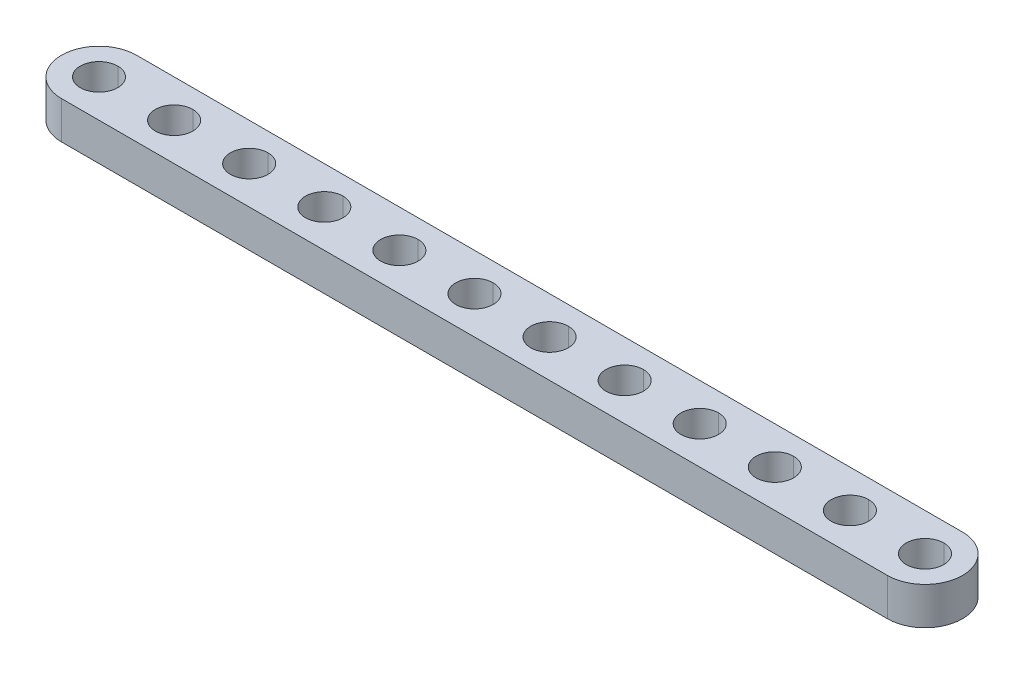
ISO-10303-21;
HEADER;
FILE_DESCRIPTION(('STEP AP214'),'2;1');
FILE_NAME('part.step','',(''),(''),'','','');
FILE_SCHEMA(('AUTOMOTIVE_DESIGN { 1 0 10303 214 1 1 1 1 }'));
ENDSEC;
DATA;
#1=APPLICATION_CONTEXT('core data for automotive mechanical design processes');
#2=APPLICATION_PROTOCOL_DEFINITION('international standard','automotive_design',2000,#1);
#3=PRODUCT_CONTEXT('',#1,'mechanical');
#4=PRODUCT('Part','Part','',(#3));
#5=PRODUCT_RELATED_PRODUCT_CATEGORY('part','',(#4));
#6=PRODUCT_DEFINITION_FORMATION('','',#4);
#7=PRODUCT_DEFINITION_CONTEXT('part definition',#1,'design');
#8=PRODUCT_DEFINITION('design','',#6,#7);
#9=PRODUCT_DEFINITION_SHAPE('','',#8);
#10=(LENGTH_UNIT() NAMED_UNIT(*) SI_UNIT(.MILLI.,.METRE.));
#11=(NAMED_UNIT(*) PLANE_ANGLE_UNIT() SI_UNIT($,.RADIAN.));
#12=(NAMED_UNIT(*) SI_UNIT($,.STERADIAN.) SOLID_ANGLE_UNIT());
#13=UNCERTAINTY_MEASURE_WITH_UNIT(LENGTH_MEASURE(1.E-05),#10,'distance_accuracy_value','');
#14=(GEOMETRIC_REPRESENTATION_CONTEXT(3) GLOBAL_UNCERTAINTY_ASSIGNED_CONTEXT((#13)) GLOBAL_UNIT_ASSIGNED_CONTEXT((#10,
#11,#12)) REPRESENTATION_CONTEXT('',''));
#15=CARTESIAN_POINT('',(0.,0.,0.));
#16=DIRECTION('',(0.,0.,1.));
#17=DIRECTION('',(1.,0.,0.));
#18=AXIS2_PLACEMENT_3D('',#15,#16,#17);
#19=CARTESIAN_POINT('',(44.,4.,0.));
#20=DIRECTION('',(0.,1.,0.));
#21=DIRECTION('',(0.,0.,1.));
#22=AXIS2_PLACEMENT_3D('',#19,#20,#21);
#23=CYLINDRICAL_SURFACE('',#22,2.);
#24=DIRECTION('',(0.,1.,0.));
#25=VECTOR('',#24,1.);
#26=CARTESIAN_POINT('',(44.,4.,-2.));
#27=LINE('',#26,#25);
#28=CARTESIAN_POINT('',(44.,0.,-2.));
#29=VERTEX_POINT('',#28);
#30=CARTESIAN_POINT('',(44.,4.,-2.));
#31=VERTEX_POINT('',#30);
#32=EDGE_CURVE('E409',#29,#31,#27,.T.);
#33=ORIENTED_EDGE('',*,*,#32,.F.);
#34=CARTESIAN_POINT('',(44.,0.,0.));
#35=DIRECTION('',(0.,1.,0.));
#36=DIRECTION('',(0.,0.,1.));
#37=AXIS2_PLACEMENT_3D('',#34,#35,#36);
#38=CIRCLE('',#37,2.);
#39=CARTESIAN_POINT('',(44.,0.,2.));
#40=VERTEX_POINT('',#39);
#41=EDGE_CURVE('E397',#40,#29,#38,.T.);
#42=ORIENTED_EDGE('',*,*,#41,.F.);
#43=DIRECTION('',(0.,1.,0.));
#44=VECTOR('',#43,1.);
#45=CARTESIAN_POINT('',(44.,4.,2.));
#46=LINE('',#45,#44);
#47=CARTESIAN_POINT('',(44.,4.,2.));
#48=VERTEX_POINT('',#47);
#49=EDGE_CURVE('E379',#40,#48,#46,.T.);
#50=ORIENTED_EDGE('',*,*,#49,.T.);
#51=CARTESIAN_POINT('',(44.,4.,0.));
#52=DIRECTION('',(0.,1.,0.));
#53=DIRECTION('',(0.,0.,1.));
#54=AXIS2_PLACEMENT_3D('',#51,#52,#53);
#55=CIRCLE('',#54,2.);
#56=EDGE_CURVE('E262',#48,#31,#55,.T.);
#57=ORIENTED_EDGE('',*,*,#56,.T.);
#58=EDGE_LOOP('',(#33,#42,#50,#57));
#59=FACE_BOUND('',#58,.T.);
#60=ADVANCED_FACE('F15',(#59),#23,.F.);
#61=CARTESIAN_POINT('',(36.,4.,0.));
#62=DIRECTION('',(0.,1.,0.));
#63=DIRECTION('',(0.,0.,1.));
#64=AXIS2_PLACEMENT_3D('',#61,#62,#63);
#65=CYLINDRICAL_SURFACE('',#64,2.);
#66=DIRECTION('',(0.,1.,0.));
#67=VECTOR('',#66,1.);
#68=CARTESIAN_POINT('',(36.,4.,-2.));
#69=LINE('',#68,#67);
#70=CARTESIAN_POINT('',(36.,0.,-2.));
#71=VERTEX_POINT('',#70);
#72=CARTESIAN_POINT('',(36.,4.,-2.));
#73=VERTEX_POINT('',#72);
#74=EDGE_CURVE('E378',#71,#73,#69,.T.);
#75=ORIENTED_EDGE('',*,*,#74,.F.);
#76=CARTESIAN_POINT('',(36.,0.,0.));
#77=DIRECTION('',(0.,1.,0.));
#78=DIRECTION('',(0.,0.,1.));
#79=AXIS2_PLACEMENT_3D('',#76,#77,#78);
#80=CIRCLE('',#79,2.);
#81=CARTESIAN_POINT('',(36.,0.,2.));
#82=VERTEX_POINT('',#81);
#83=EDGE_CURVE('E216',#82,#71,#80,.T.);
#84=ORIENTED_EDGE('',*,*,#83,.F.);
#85=DIRECTION('',(0.,1.,0.));
#86=VECTOR('',#85,1.);
#87=CARTESIAN_POINT('',(36.,4.,2.));
#88=LINE('',#87,#86);
#89=CARTESIAN_POINT('',(36.,4.,2.));
#90=VERTEX_POINT('',#89);
#91=EDGE_CURVE('E337',#82,#90,#88,.T.);
#92=ORIENTED_EDGE('',*,*,#91,.T.);
#93=CARTESIAN_POINT('',(36.,4.,0.));
#94=DIRECTION('',(0.,1.,0.));
#95=DIRECTION('',(0.,0.,1.));
#96=AXIS2_PLACEMENT_3D('',#93,#94,#95);
#97=CIRCLE('',#96,2.);
#98=EDGE_CURVE('E266',#90,#73,#97,.T.);
#99=ORIENTED_EDGE('',*,*,#98,.T.);
#100=EDGE_LOOP('',(#75,#84,#92,#99));
#101=FACE_BOUND('',#100,.T.);
#102=ADVANCED_FACE('F509',(#101),#65,.F.);
#103=CARTESIAN_POINT('',(28.,4.,0.));
#104=DIRECTION('',(0.,1.,0.));
#105=DIRECTION('',(0.,0.,1.));
#106=AXIS2_PLACEMENT_3D('',#103,#104,#105);
#107=CYLINDRICAL_SURFACE('',#106,2.);
#108=DIRECTION('',(0.,1.,0.));
#109=VECTOR('',#108,1.);
#110=CARTESIAN_POINT('',(28.,4.,-2.));
#111=LINE('',#110,#109);
#112=CARTESIAN_POINT('',(28.,0.,-2.));
#113=VERTEX_POINT('',#112);
#114=CARTESIAN_POINT('',(28.,4.,-2.));
#115=VERTEX_POINT('',#114);
#116=EDGE_CURVE('E314',#113,#115,#111,.T.);
#117=ORIENTED_EDGE('',*,*,#116,.F.);
#118=CARTESIAN_POINT('',(28.,0.,0.));
#119=DIRECTION('',(0.,1.,0.));
#120=DIRECTION('',(0.,0.,1.));
#121=AXIS2_PLACEMENT_3D('',#118,#119,#120);
#122=CIRCLE('',#121,2.);
#123=CARTESIAN_POINT('',(28.,0.,2.));
#124=VERTEX_POINT('',#123);
#125=EDGE_CURVE('E212',#124,#113,#122,.T.);
#126=ORIENTED_EDGE('',*,*,#125,.F.);
#127=DIRECTION('',(0.,1.,0.));
#128=VECTOR('',#127,1.);
#129=CARTESIAN_POINT('',(28.,4.,2.));
#130=LINE('',#129,#128);
#131=CARTESIAN_POINT('',(28.,4.,2.));
#132=VERTEX_POINT('',#131);
#133=EDGE_CURVE('E271',#124,#132,#130,.T.);
#134=ORIENTED_EDGE('',*,*,#133,.T.);
#135=CARTESIAN_POINT('',(28.,4.,0.));
#136=DIRECTION('',(0.,1.,0.));
#137=DIRECTION('',(0.,0.,1.));
#138=AXIS2_PLACEMENT_3D('',#135,#136,#137);
#139=CIRCLE('',#138,2.);
#140=EDGE_CURVE('E205',#132,#115,#139,.T.);
#141=ORIENTED_EDGE('',*,*,#140,.T.);
#142=EDGE_LOOP('',(#117,#126,#134,#141));
#143=FACE_BOUND('',#142,.T.);
#144=ADVANCED_FACE('F310',(#143),#107,.F.);
#145=CARTESIAN_POINT('',(20.,4.,0.));
#146=DIRECTION('',(0.,1.,0.));
#147=DIRECTION('',(0.,0.,1.));
#148=AXIS2_PLACEMENT_3D('',#145,#146,#147);
#149=CYLINDRICAL_SURFACE('',#148,2.);
#150=DIRECTION('',(0.,1.,0.));
#151=VECTOR('',#150,1.);
#152=CARTESIAN_POINT('',(20.,4.,-2.));
#153=LINE('',#152,#151);
#154=CARTESIAN_POINT('',(20.,0.,-2.));
#155=VERTEX_POINT('',#154);
#156=CARTESIAN_POINT('',(20.,4.,-2.));
#157=VERTEX_POINT('',#156);
#158=EDGE_CURVE('E270',#155,#157,#153,.T.);
#159=ORIENTED_EDGE('',*,*,#158,.F.);
#160=CARTESIAN_POINT('',(20.,0.,0.));
#161=DIRECTION('',(0.,1.,0.));
#162=DIRECTION('',(0.,0.,1.));
#163=AXIS2_PLACEMENT_3D('',#160,#161,#162);
#164=CIRCLE('',#163,2.);
#165=CARTESIAN_POINT('',(20.,0.,2.));
#166=VERTEX_POINT('',#165);
#167=EDGE_CURVE('E19',#166,#155,#164,.T.);
#168=ORIENTED_EDGE('',*,*,#167,.F.);
#169=DIRECTION('',(0.,1.,0.));
#170=VECTOR('',#169,1.);
#171=CARTESIAN_POINT('',(20.,4.,2.));
#172=LINE('',#171,#170);
#173=CARTESIAN_POINT('',(20.,4.,2.));
#174=VERTEX_POINT('',#173);
#175=EDGE_CURVE('E254',#166,#174,#172,.T.);
#176=ORIENTED_EDGE('',*,*,#175,.T.);
#177=CARTESIAN_POINT('',(20.,4.,0.));
#178=DIRECTION('',(0.,1.,0.));
#179=DIRECTION('',(0.,0.,1.));
#180=AXIS2_PLACEMENT_3D('',#177,#178,#179);
#181=CIRCLE('',#180,2.);
#182=EDGE_CURVE('E201',#174,#157,#181,.T.);
#183=ORIENTED_EDGE('',*,*,#182,.T.);
#184=EDGE_LOOP('',(#159,#168,#176,#183));
#185=FACE_BOUND('',#184,.T.);
#186=ADVANCED_FACE('F452',(#185),#149,.F.);
#187=CARTESIAN_POINT('',(12.,4.,0.));
#188=DIRECTION('',(0.,1.,0.));
#189=DIRECTION('',(0.,0.,1.));
#190=AXIS2_PLACEMENT_3D('',#187,#188,#189);
#191=CYLINDRICAL_SURFACE('',#190,2.);
#192=DIRECTION('',(0.,1.,0.));
#193=VECTOR('',#192,1.);
#194=CARTESIAN_POINT('',(12.,4.,-2.));
#195=LINE('',#194,#193);
#196=CARTESIAN_POINT('',(12.,0.,-2.));
#197=VERTEX_POINT('',#196);
#198=CARTESIAN_POINT('',(12.,4.,-2.));
#199=VERTEX_POINT('',#198);
#200=EDGE_CURVE('E253',#197,#199,#195,.T.);
#201=ORIENTED_EDGE('',*,*,#200,.F.);
#202=CARTESIAN_POINT('',(12.,0.,0.));
#203=DIRECTION('',(0.,1.,0.));
#204=DIRECTION('',(0.,0.,1.));
#205=AXIS2_PLACEMENT_3D('',#202,#203,#204);
#206=CIRCLE('',#205,2.);
#207=CARTESIAN_POINT('',(12.,0.,2.));
#208=VERTEX_POINT('',#207);
#209=EDGE_CURVE('E396',#208,#197,#206,.T.);
#210=ORIENTED_EDGE('',*,*,#209,.F.);
#211=DIRECTION('',(0.,1.,0.));
#212=VECTOR('',#211,1.);
#213=CARTESIAN_POINT('',(12.,4.,2.));
#214=LINE('',#213,#212);
#215=CARTESIAN_POINT('',(12.,4.,2.));
#216=VERTEX_POINT('',#215);
#217=EDGE_CURVE('E296',#208,#216,#214,.T.);
#218=ORIENTED_EDGE('',*,*,#217,.T.);
#219=CARTESIAN_POINT('',(12.,4.,0.));
#220=DIRECTION('',(0.,1.,0.));
#221=DIRECTION('',(0.,0.,1.));
#222=AXIS2_PLACEMENT_3D('',#219,#220,#221);
#223=CIRCLE('',#222,2.);
#224=EDGE_CURVE('E204',#216,#199,#223,.T.);
#225=ORIENTED_EDGE('',*,*,#224,.T.);
#226=EDGE_LOOP('',(#201,#210,#218,#225));
#227=FACE_BOUND('',#226,.T.);
#228=ADVANCED_FACE('F17',(#227),#191,.F.);
#229=CARTESIAN_POINT('',(4.,4.,0.));
#230=DIRECTION('',(0.,1.,0.));
#231=DIRECTION('',(0.,0.,1.));
#232=AXIS2_PLACEMENT_3D('',#229,#230,#231);
#233=CYLINDRICAL_SURFACE('',#232,2.);
#234=DIRECTION('',(0.,1.,0.));
#235=VECTOR('',#234,1.);
#236=CARTESIAN_POINT('',(4.,4.,-2.));
#237=LINE('',#236,#235);
#238=CARTESIAN_POINT('',(4.,0.,-2.));
#239=VERTEX_POINT('',#238);
#240=CARTESIAN_POINT('',(4.,4.,-2.));
#241=VERTEX_POINT('',#240);
#242=EDGE_CURVE('E245',#239,#241,#237,.T.);
#243=ORIENTED_EDGE('',*,*,#242,.F.);
#244=CARTESIAN_POINT('',(4.,0.,0.));
#245=DIRECTION('',(0.,1.,0.));
#246=DIRECTION('',(0.,0.,1.));
#247=AXIS2_PLACEMENT_3D('',#244,#245,#246);
#248=CIRCLE('',#247,2.);
#249=CARTESIAN_POINT('',(4.,0.,2.));
#250=VERTEX_POINT('',#249);
#251=EDGE_CURVE('E221',#250,#239,#248,.T.);
#252=ORIENTED_EDGE('',*,*,#251,.F.);
#253=DIRECTION('',(0.,1.,0.));
#254=VECTOR('',#253,1.);
#255=CARTESIAN_POINT('',(4.,4.,2.));
#256=LINE('',#255,#254);
#257=CARTESIAN_POINT('',(4.,4.,2.));
#258=VERTEX_POINT('',#257);
#259=EDGE_CURVE('E244',#250,#258,#256,.T.);
#260=ORIENTED_EDGE('',*,*,#259,.T.);
#261=CARTESIAN_POINT('',(4.,4.,0.));
#262=DIRECTION('',(0.,1.,0.));
#263=DIRECTION('',(0.,0.,1.));
#264=AXIS2_PLACEMENT_3D('',#261,#262,#263);
#265=CIRCLE('',#264,2.);
#266=EDGE_CURVE('E211',#258,#241,#265,.T.);
#267=ORIENTED_EDGE('',*,*,#266,.T.);
#268=EDGE_LOOP('',(#243,#252,#260,#267));
#269=FACE_BOUND('',#268,.T.);
#270=ADVANCED_FACE('F651',(#269),#233,.F.);
#271=CARTESIAN_POINT('',(-4.,4.,0.));
#272=DIRECTION('',(0.,1.,0.));
#273=DIRECTION('',(0.,0.,1.));
#274=AXIS2_PLACEMENT_3D('',#271,#272,#273);
#275=CYLINDRICAL_SURFACE('',#274,2.);
#276=DIRECTION('',(0.,1.,0.));
#277=VECTOR('',#276,1.);
#278=CARTESIAN_POINT('',(-4.,4.,-2.));
#279=LINE('',#278,#277);
#280=CARTESIAN_POINT('',(-4.,0.,-2.));
#281=VERTEX_POINT('',#280);
#282=CARTESIAN_POINT('',(-4.,4.,-2.));
#283=VERTEX_POINT('',#282);
#284=EDGE_CURVE('E276',#281,#283,#279,.T.);
#285=ORIENTED_EDGE('',*,*,#284,.F.);
#286=CARTESIAN_POINT('',(-4.,0.,0.));
#287=DIRECTION('',(0.,1.,0.));
#288=DIRECTION('',(0.,0.,1.));
#289=AXIS2_PLACEMENT_3D('',#286,#287,#288);
#290=CIRCLE('',#289,2.);
#291=CARTESIAN_POINT('',(-4.,0.,2.));
#292=VERTEX_POINT('',#291);
#293=EDGE_CURVE('E217',#292,#281,#290,.T.);
#294=ORIENTED_EDGE('',*,*,#293,.F.);
#295=DIRECTION('',(0.,1.,0.));
#296=VECTOR('',#295,1.);
#297=CARTESIAN_POINT('',(-4.,4.,2.));
#298=LINE('',#297,#296);
#299=CARTESIAN_POINT('',(-4.,4.,2.));
#300=VERTEX_POINT('',#299);
#301=EDGE_CURVE('E369',#292,#300,#298,.T.);
#302=ORIENTED_EDGE('',*,*,#301,.T.);
#303=CARTESIAN_POINT('',(-4.,4.,0.));
#304=DIRECTION('',(0.,1.,0.));
#305=DIRECTION('',(0.,0.,1.));
#306=AXIS2_PLACEMENT_3D('',#303,#304,#305);
#307=CIRCLE('',#306,2.);
#308=EDGE_CURVE('E206',#300,#283,#307,.T.);
#309=ORIENTED_EDGE('',*,*,#308,.T.);
#310=EDGE_LOOP('',(#285,#294,#302,#309));
#311=FACE_BOUND('',#310,.T.);
#312=ADVANCED_FACE('F777',(#311),#275,.F.);
#313=CARTESIAN_POINT('',(-12.,4.,0.));
#314=DIRECTION('',(0.,1.,0.));
#315=DIRECTION('',(0.,0.,1.));
#316=AXIS2_PLACEMENT_3D('',#313,#314,#315);
#317=CYLINDRICAL_SURFACE('',#316,2.);
#318=DIRECTION('',(0.,1.,0.));
#319=VECTOR('',#318,1.);
#320=CARTESIAN_POINT('',(-12.,4.,-2.));
#321=LINE('',#320,#319);
#322=CARTESIAN_POINT('',(-12.,0.,-2.));
#323=VERTEX_POINT('',#322);
#324=CARTESIAN_POINT('',(-12.,4.,-2.));
#325=VERTEX_POINT('',#324);
#326=EDGE_CURVE('E361',#323,#325,#321,.T.);
#327=ORIENTED_EDGE('',*,*,#326,.F.);
#328=CARTESIAN_POINT('',(-12.,0.,0.));
#329=DIRECTION('',(0.,1.,0.));
#330=DIRECTION('',(0.,0.,1.));
#331=AXIS2_PLACEMENT_3D('',#328,#329,#330);
#332=CIRCLE('',#331,2.);
#333=CARTESIAN_POINT('',(-12.,0.,2.));
#334=VERTEX_POINT('',#333);
#335=EDGE_CURVE('E220',#334,#323,#332,.T.);
#336=ORIENTED_EDGE('',*,*,#335,.F.);
#337=DIRECTION('',(0.,1.,0.));
#338=VECTOR('',#337,1.);
#339=CARTESIAN_POINT('',(-12.,4.,2.));
#340=LINE('',#339,#338);
#341=CARTESIAN_POINT('',(-12.,4.,2.));
#342=VERTEX_POINT('',#341);
#343=EDGE_CURVE('E360',#334,#342,#340,.T.);
#344=ORIENTED_EDGE('',*,*,#343,.T.);
#345=CARTESIAN_POINT('',(-12.,4.,0.));
#346=DIRECTION('',(0.,1.,0.));
#347=DIRECTION('',(0.,0.,1.));
#348=AXIS2_PLACEMENT_3D('',#345,#346,#347);
#349=CIRCLE('',#348,2.);
#350=EDGE_CURVE('E210',#342,#325,#349,.T.);
#351=ORIENTED_EDGE('',*,*,#350,.T.);
#352=EDGE_LOOP('',(#327,#336,#344,#351));
#353=FACE_BOUND('',#352,.T.);
#354=ADVANCED_FACE('F430',(#353),#317,.F.);
#355=CARTESIAN_POINT('',(-20.,4.,0.));
#356=DIRECTION('',(0.,1.,0.));
#357=DIRECTION('',(0.,0.,1.));
#358=AXIS2_PLACEMENT_3D('',#355,#356,#357);
#359=CYLINDRICAL_SURFACE('',#358,2.);
#360=DIRECTION('',(0.,1.,0.));
#361=VECTOR('',#360,1.);
#362=CARTESIAN_POINT('',(-20.,4.,-2.));
#363=LINE('',#362,#361);
#364=CARTESIAN_POINT('',(-20.,0.,-2.));
#365=VERTEX_POINT('',#364);
#366=CARTESIAN_POINT('',(-20.,4.,-2.));
#367=VERTEX_POINT('',#366);
#368=EDGE_CURVE('E392',#365,#367,#363,.T.);
#369=ORIENTED_EDGE('',*,*,#368,.F.);
#370=CARTESIAN_POINT('',(-20.,0.,0.));
#371=DIRECTION('',(0.,1.,0.));
#372=DIRECTION('',(0.,0.,1.));
#373=AXIS2_PLACEMENT_3D('',#370,#371,#372);
#374=CIRCLE('',#373,2.);
#375=CARTESIAN_POINT('',(-20.,0.,2.));
#376=VERTEX_POINT('',#375);
#377=EDGE_CURVE('E224',#376,#365,#374,.T.);
#378=ORIENTED_EDGE('',*,*,#377,.F.);
#379=DIRECTION('',(0.,1.,0.));
#380=VECTOR('',#379,1.);
#381=CARTESIAN_POINT('',(-20.,4.,2.));
#382=LINE('',#381,#380);
#383=CARTESIAN_POINT('',(-20.,4.,2.));
#384=VERTEX_POINT('',#383);
#385=EDGE_CURVE('E297',#376,#384,#382,.T.);
#386=ORIENTED_EDGE('',*,*,#385,.T.);
#387=CARTESIAN_POINT('',(-20.,4.,0.));
#388=DIRECTION('',(0.,1.,0.));
#389=DIRECTION('',(0.,0.,1.));
#390=AXIS2_PLACEMENT_3D('',#387,#388,#389);
#391=CIRCLE('',#390,2.);
#392=EDGE_CURVE('E284',#384,#367,#391,.T.);
#393=ORIENTED_EDGE('',*,*,#392,.T.);
#394=EDGE_LOOP('',(#369,#378,#386,#393));
#395=FACE_BOUND('',#394,.T.);
#396=ADVANCED_FACE('F995',(#395),#359,.F.);
#397=CARTESIAN_POINT('',(-28.,4.,0.));
#398=DIRECTION('',(0.,1.,0.));
#399=DIRECTION('',(0.,0.,1.));
#400=AXIS2_PLACEMENT_3D('',#397,#398,#399);
#401=CYLINDRICAL_SURFACE('',#400,2.);
#402=DIRECTION('',(0.,1.,0.));
#403=VECTOR('',#402,1.);
#404=CARTESIAN_POINT('',(-28.,4.,-2.));
#405=LINE('',#404,#403);
#406=CARTESIAN_POINT('',(-28.,0.,-2.));
#407=VERTEX_POINT('',#406);
#408=CARTESIAN_POINT('',(-28.,4.,-2.));
#409=VERTEX_POINT('',#408);
#410=EDGE_CURVE('E234',#407,#409,#405,.T.);
#411=ORIENTED_EDGE('',*,*,#410,.F.);
#412=CARTESIAN_POINT('',(-28.,0.,0.));
#413=DIRECTION('',(0.,1.,0.));
#414=DIRECTION('',(0.,0.,1.));
#415=AXIS2_PLACEMENT_3D('',#412,#413,#414);
#416=CIRCLE('',#415,2.);
#417=CARTESIAN_POINT('',(-28.,0.,2.));
#418=VERTEX_POINT('',#417);
#419=EDGE_CURVE('E230',#418,#407,#416,.T.);
#420=ORIENTED_EDGE('',*,*,#419,.F.);
#421=DIRECTION('',(0.,1.,0.));
#422=VECTOR('',#421,1.);
#423=CARTESIAN_POINT('',(-28.,4.,2.));
#424=LINE('',#423,#422);
#425=CARTESIAN_POINT('',(-28.,4.,2.));
#426=VERTEX_POINT('',#425);
#427=EDGE_CURVE('E470',#418,#426,#424,.T.);
#428=ORIENTED_EDGE('',*,*,#427,.T.);
#429=CARTESIAN_POINT('',(-28.,4.,0.));
#430=DIRECTION('',(0.,1.,0.));
#431=DIRECTION('',(0.,0.,1.));
#432=AXIS2_PLACEMENT_3D('',#429,#430,#431);
#433=CIRCLE('',#432,2.);
#434=EDGE_CURVE('E166',#426,#409,#433,.T.);
#435=ORIENTED_EDGE('',*,*,#434,.T.);
#436=EDGE_LOOP('',(#411,#420,#428,#435));
#437=FACE_BOUND('',#436,.T.);
#438=ADVANCED_FACE('F894',(#437),#401,.F.);
#439=CARTESIAN_POINT('',(-36.,4.,0.));
#440=DIRECTION('',(0.,1.,0.));
#441=DIRECTION('',(0.,0.,1.));
#442=AXIS2_PLACEMENT_3D('',#439,#440,#441);
#443=CYLINDRICAL_SURFACE('',#442,2.);
#444=DIRECTION('',(0.,1.,0.));
#445=VECTOR('',#444,1.);
#446=CARTESIAN_POINT('',(-36.,4.,-2.));
#447=LINE('',#446,#445);
#448=CARTESIAN_POINT('',(-36.,0.,-2.));
#449=VERTEX_POINT('',#448);
#450=CARTESIAN_POINT('',(-36.,4.,-2.));
#451=VERTEX_POINT('',#450);
#452=EDGE_CURVE('E179',#449,#451,#447,.T.);
#453=ORIENTED_EDGE('',*,*,#452,.F.);
#454=CARTESIAN_POINT('',(-36.,0.,0.));
#455=DIRECTION('',(0.,1.,0.));
#456=DIRECTION('',(0.,0.,1.));
#457=AXIS2_PLACEMENT_3D('',#454,#455,#456);
#458=CIRCLE('',#457,2.);
#459=CARTESIAN_POINT('',(-36.,0.,2.));
#460=VERTEX_POINT('',#459);
#461=EDGE_CURVE('E26',#460,#449,#458,.T.);
#462=ORIENTED_EDGE('',*,*,#461,.F.);
#463=DIRECTION('',(0.,1.,0.));
#464=VECTOR('',#463,1.);
#465=CARTESIAN_POINT('',(-36.,4.,2.));
#466=LINE('',#465,#464);
#467=CARTESIAN_POINT('',(-36.,4.,2.));
#468=VERTEX_POINT('',#467);
#469=EDGE_CURVE('E170',#460,#468,#466,.T.);
#470=ORIENTED_EDGE('',*,*,#469,.T.);
#471=CARTESIAN_POINT('',(-36.,4.,0.));
#472=DIRECTION('',(0.,1.,0.));
#473=DIRECTION('',(0.,0.,1.));
#474=AXIS2_PLACEMENT_3D('',#471,#472,#473);
#475=CIRCLE('',#474,2.);
#476=EDGE_CURVE('E155',#468,#451,#475,.T.);
#477=ORIENTED_EDGE('',*,*,#476,.T.);
#478=EDGE_LOOP('',(#453,#462,#470,#477));
#479=FACE_BOUND('',#478,.T.);
#480=ADVANCED_FACE('F171',(#479),#443,.F.);
#481=CARTESIAN_POINT('',(-44.,4.,0.));
#482=DIRECTION('',(0.,1.,0.));
#483=DIRECTION('',(0.,0.,1.));
#484=AXIS2_PLACEMENT_3D('',#481,#482,#483);
#485=CYLINDRICAL_SURFACE('',#484,2.);
#486=DIRECTION('',(0.,1.,0.));
#487=VECTOR('',#486,1.);
#488=CARTESIAN_POINT('',(-44.,4.,-2.));
#489=LINE('',#488,#487);
#490=CARTESIAN_POINT('',(-44.,0.,-2.));
#491=VERTEX_POINT('',#490);
#492=CARTESIAN_POINT('',(-44.,4.,-2.));
#493=VERTEX_POINT('',#492);
#494=EDGE_CURVE('E195',#491,#493,#489,.T.);
#495=ORIENTED_EDGE('',*,*,#494,.F.);
#496=CARTESIAN_POINT('',(-44.,0.,0.));
#497=DIRECTION('',(0.,1.,0.));
#498=DIRECTION('',(0.,0.,1.));
#499=AXIS2_PLACEMENT_3D('',#496,#497,#498);
#500=CIRCLE('',#499,2.);
#501=CARTESIAN_POINT('',(-44.,0.,2.));
#502=VERTEX_POINT('',#501);
#503=EDGE_CURVE('E10',#502,#491,#500,.T.);
#504=ORIENTED_EDGE('',*,*,#503,.F.);
#505=DIRECTION('',(0.,1.,0.));
#506=VECTOR('',#505,1.);
#507=CARTESIAN_POINT('',(-44.,4.,2.));
#508=LINE('',#507,#506);
#509=CARTESIAN_POINT('',(-44.,4.,2.));
#510=VERTEX_POINT('',#509);
#511=EDGE_CURVE('E347',#502,#510,#508,.T.);
#512=ORIENTED_EDGE('',*,*,#511,.T.);
#513=CARTESIAN_POINT('',(-44.,4.,0.));
#514=DIRECTION('',(0.,1.,0.));
#515=DIRECTION('',(0.,0.,1.));
#516=AXIS2_PLACEMENT_3D('',#513,#514,#515);
#517=CIRCLE('',#516,2.);
#518=EDGE_CURVE('E165',#510,#493,#517,.T.);
#519=ORIENTED_EDGE('',*,*,#518,.T.);
#520=EDGE_LOOP('',(#495,#504,#512,#519));
#521=FACE_BOUND('',#520,.T.);
#522=ADVANCED_FACE('F658',(#521),#485,.F.);
#523=CARTESIAN_POINT('',(-44.,0.,0.));
#524=DIRECTION('',(0.,1.,0.));
#525=DIRECTION('',(1.,0.,0.));
#526=AXIS2_PLACEMENT_3D('',#523,#524,#525);
#527=PLANE('',#526);
#528=ORIENTED_EDGE('',*,*,#503,.T.);
#529=CARTESIAN_POINT('',(-44.,0.,0.));
#530=DIRECTION('',(0.,1.,0.));
#531=DIRECTION('',(0.,0.,1.));
#532=AXIS2_PLACEMENT_3D('',#529,#530,#531);
#533=CIRCLE('',#532,2.);
#534=EDGE_CURVE('E176',#491,#502,#533,.T.);
#535=ORIENTED_EDGE('',*,*,#534,.T.);
#536=EDGE_LOOP('',(#528,#535));
#537=FACE_BOUND('',#536,.T.);
#538=ORIENTED_EDGE('',*,*,#461,.T.);
#539=CARTESIAN_POINT('',(-36.,0.,0.));
#540=DIRECTION('',(0.,1.,0.));
#541=DIRECTION('',(0.,0.,1.));
#542=AXIS2_PLACEMENT_3D('',#539,#540,#541);
#543=CIRCLE('',#542,2.);
#544=EDGE_CURVE('E187',#449,#460,#543,.T.);
#545=ORIENTED_EDGE('',*,*,#544,.T.);
#546=EDGE_LOOP('',(#538,#545));
#547=FACE_BOUND('',#546,.T.);
#548=ORIENTED_EDGE('',*,*,#419,.T.);
#549=CARTESIAN_POINT('',(-28.,0.,0.));
#550=DIRECTION('',(0.,1.,0.));
#551=DIRECTION('',(0.,0.,1.));
#552=AXIS2_PLACEMENT_3D('',#549,#550,#551);
#553=CIRCLE('',#552,2.);
#554=EDGE_CURVE('E239',#407,#418,#553,.T.);
#555=ORIENTED_EDGE('',*,*,#554,.T.);
#556=EDGE_LOOP('',(#548,#555));
#557=FACE_BOUND('',#556,.T.);
#558=ORIENTED_EDGE('',*,*,#377,.T.);
#559=CARTESIAN_POINT('',(-20.,0.,0.));
#560=DIRECTION('',(0.,1.,0.));
#561=DIRECTION('',(0.,0.,1.));
#562=AXIS2_PLACEMENT_3D('',#559,#560,#561);
#563=CIRCLE('',#562,2.);
#564=EDGE_CURVE('E388',#365,#376,#563,.T.);
#565=ORIENTED_EDGE('',*,*,#564,.T.);
#566=EDGE_LOOP('',(#558,#565));
#567=FACE_BOUND('',#566,.T.);
#568=ORIENTED_EDGE('',*,*,#335,.T.);
#569=CARTESIAN_POINT('',(-12.,0.,0.));
#570=DIRECTION('',(0.,1.,0.));
#571=DIRECTION('',(0.,0.,1.));
#572=AXIS2_PLACEMENT_3D('',#569,#570,#571);
#573=CIRCLE('',#572,2.);
#574=EDGE_CURVE('E365',#323,#334,#573,.T.);
#575=ORIENTED_EDGE('',*,*,#574,.T.);
#576=EDGE_LOOP('',(#568,#575));
#577=FACE_BOUND('',#576,.T.);
#578=ORIENTED_EDGE('',*,*,#293,.T.);
#579=CARTESIAN_POINT('',(-4.,0.,0.));
#580=DIRECTION('',(0.,1.,0.));
#581=DIRECTION('',(0.,0.,1.));
#582=AXIS2_PLACEMENT_3D('',#579,#580,#581);
#583=CIRCLE('',#582,2.);
#584=EDGE_CURVE('E272',#281,#292,#583,.T.);
#585=ORIENTED_EDGE('',*,*,#584,.T.);
#586=EDGE_LOOP('',(#578,#585));
#587=FACE_BOUND('',#586,.T.);
#588=ORIENTED_EDGE('',*,*,#251,.T.);
#589=CARTESIAN_POINT('',(4.,0.,0.));
#590=DIRECTION('',(0.,1.,0.));
#591=DIRECTION('',(0.,0.,1.));
#592=AXIS2_PLACEMENT_3D('',#589,#590,#591);
#593=CIRCLE('',#592,2.);
#594=EDGE_CURVE('E387',#239,#250,#593,.T.);
#595=ORIENTED_EDGE('',*,*,#594,.T.);
#596=EDGE_LOOP('',(#588,#595));
#597=FACE_BOUND('',#596,.T.);
#598=ORIENTED_EDGE('',*,*,#209,.T.);
#599=CARTESIAN_POINT('',(12.,0.,0.));
#600=DIRECTION('',(0.,1.,0.));
#601=DIRECTION('',(0.,0.,1.));
#602=AXIS2_PLACEMENT_3D('',#599,#600,#601);
#603=CIRCLE('',#602,2.);
#604=EDGE_CURVE('E250',#197,#208,#603,.T.);
#605=ORIENTED_EDGE('',*,*,#604,.T.);
#606=EDGE_LOOP('',(#598,#605));
#607=FACE_BOUND('',#606,.T.);
#608=ORIENTED_EDGE('',*,*,#167,.T.);
#609=CARTESIAN_POINT('',(20.,0.,0.));
#610=DIRECTION('',(0.,1.,0.));
#611=DIRECTION('',(0.,0.,1.));
#612=AXIS2_PLACEMENT_3D('',#609,#610,#611);
#613=CIRCLE('',#612,2.);
#614=EDGE_CURVE('E267',#155,#166,#613,.T.);
#615=ORIENTED_EDGE('',*,*,#614,.T.);
#616=EDGE_LOOP('',(#608,#615));
#617=FACE_BOUND('',#616,.T.);
#618=ORIENTED_EDGE('',*,*,#125,.T.);
#619=CARTESIAN_POINT('',(28.,0.,0.));
#620=DIRECTION('',(0.,1.,0.));
#621=DIRECTION('',(0.,0.,1.));
#622=AXIS2_PLACEMENT_3D('',#619,#620,#621);
#623=CIRCLE('',#622,2.);
#624=EDGE_CURVE('E329',#113,#124,#623,.T.);
#625=ORIENTED_EDGE('',*,*,#624,.T.);
#626=EDGE_LOOP('',(#618,#625));
#627=FACE_BOUND('',#626,.T.);
#628=ORIENTED_EDGE('',*,*,#83,.T.);
#629=CARTESIAN_POINT('',(36.,0.,0.));
#630=DIRECTION('',(0.,1.,0.));
#631=DIRECTION('',(0.,0.,1.));
#632=AXIS2_PLACEMENT_3D('',#629,#630,#631);
#633=CIRCLE('',#632,2.);
#634=EDGE_CURVE('E374',#71,#82,#633,.T.);
#635=ORIENTED_EDGE('',*,*,#634,.T.);
#636=EDGE_LOOP('',(#628,#635));
#637=FACE_BOUND('',#636,.T.);
#638=ORIENTED_EDGE('',*,*,#41,.T.);
#639=CARTESIAN_POINT('',(44.,0.,0.));
#640=DIRECTION('',(0.,1.,0.));
#641=DIRECTION('',(0.,0.,1.));
#642=AXIS2_PLACEMENT_3D('',#639,#640,#641);
#643=CIRCLE('',#642,2.);
#644=EDGE_CURVE('E405',#29,#40,#643,.T.);
#645=ORIENTED_EDGE('',*,*,#644,.T.);
#646=EDGE_LOOP('',(#638,#645));
#647=FACE_BOUND('',#646,.T.);
#648=CARTESIAN_POINT('',(-44.,0.,0.));
#649=DIRECTION('',(0.,1.,0.));
#650=DIRECTION('',(0.,0.,1.));
#651=AXIS2_PLACEMENT_3D('',#648,#649,#650);
#652=CIRCLE('',#651,4.);
#653=CARTESIAN_POINT('',(-44.,0.,-4.));
#654=VERTEX_POINT('',#653);
#655=CARTESIAN_POINT('',(-44.,0.,4.));
#656=VERTEX_POINT('',#655);
#657=EDGE_CURVE('E261',#654,#656,#652,.T.);
#658=ORIENTED_EDGE('',*,*,#657,.F.);
#659=DIRECTION('',(-1.,0.,0.));
#660=VECTOR('',#659,1.);
#661=CARTESIAN_POINT('',(-44.,0.,-4.));
#662=LINE('',#661,#660);
#663=CARTESIAN_POINT('',(44.,0.,-4.));
#664=VERTEX_POINT('',#663);
#665=EDGE_CURVE('E288',#664,#654,#662,.T.);
#666=ORIENTED_EDGE('',*,*,#665,.F.);
#667=CARTESIAN_POINT('',(44.,0.,0.));
#668=DIRECTION('',(0.,1.,0.));
#669=DIRECTION('',(0.,0.,1.));
#670=AXIS2_PLACEMENT_3D('',#667,#668,#669);
#671=CIRCLE('',#670,4.);
#672=CARTESIAN_POINT('',(44.,0.,4.));
#673=VERTEX_POINT('',#672);
#674=EDGE_CURVE('E200',#673,#664,#671,.T.);
#675=ORIENTED_EDGE('',*,*,#674,.F.);
#676=DIRECTION('',(1.,0.,0.));
#677=VECTOR('',#676,1.);
#678=CARTESIAN_POINT('',(-44.,0.,4.));
#679=LINE('',#678,#677);
#680=EDGE_CURVE('E383',#656,#673,#679,.T.);
#681=ORIENTED_EDGE('',*,*,#680,.F.);
#682=EDGE_LOOP('',(#658,#666,#675,#681));
#683=FACE_BOUND('',#682,.T.);
#684=ADVANCED_FACE('F436',(#537,#547,#557,#567,#577,#587,#597,#607,#617,#627,#637,#647,#683),
#527,.F.);
#685=CARTESIAN_POINT('',(-44.,4.,0.));
#686=DIRECTION('',(0.,1.,0.));
#687=DIRECTION('',(1.,0.,0.));
#688=AXIS2_PLACEMENT_3D('',#685,#686,#687);
#689=PLANE('',#688);
#690=ORIENTED_EDGE('',*,*,#518,.F.);
#691=CARTESIAN_POINT('',(-44.,4.,0.));
#692=DIRECTION('',(0.,1.,0.));
#693=DIRECTION('',(0.,0.,1.));
#694=AXIS2_PLACEMENT_3D('',#691,#692,#693);
#695=CIRCLE('',#694,2.);
#696=EDGE_CURVE('E249',#493,#510,#695,.T.);
#697=ORIENTED_EDGE('',*,*,#696,.F.);
#698=EDGE_LOOP('',(#690,#697));
#699=FACE_BOUND('',#698,.T.);
#700=ORIENTED_EDGE('',*,*,#476,.F.);
#701=CARTESIAN_POINT('',(-36.,4.,0.));
#702=DIRECTION('',(0.,1.,0.));
#703=DIRECTION('',(0.,0.,1.));
#704=AXIS2_PLACEMENT_3D('',#701,#702,#703);
#705=CIRCLE('',#704,2.);
#706=EDGE_CURVE('E160',#451,#468,#705,.T.);
#707=ORIENTED_EDGE('',*,*,#706,.F.);
#708=EDGE_LOOP('',(#700,#707));
#709=FACE_BOUND('',#708,.T.);
#710=ORIENTED_EDGE('',*,*,#434,.F.);
#711=CARTESIAN_POINT('',(-28.,4.,0.));
#712=DIRECTION('',(0.,1.,0.));
#713=DIRECTION('',(0.,0.,1.));
#714=AXIS2_PLACEMENT_3D('',#711,#712,#713);
#715=CIRCLE('',#714,2.);
#716=EDGE_CURVE('E238',#409,#426,#715,.T.);
#717=ORIENTED_EDGE('',*,*,#716,.F.);
#718=EDGE_LOOP('',(#710,#717));
#719=FACE_BOUND('',#718,.T.);
#720=ORIENTED_EDGE('',*,*,#392,.F.);
#721=CARTESIAN_POINT('',(-20.,4.,0.));
#722=DIRECTION('',(0.,1.,0.));
#723=DIRECTION('',(0.,0.,1.));
#724=AXIS2_PLACEMENT_3D('',#721,#722,#723);
#725=CIRCLE('',#724,2.);
#726=EDGE_CURVE('E300',#367,#384,#725,.T.);
#727=ORIENTED_EDGE('',*,*,#726,.F.);
#728=EDGE_LOOP('',(#720,#727));
#729=FACE_BOUND('',#728,.T.);
#730=ORIENTED_EDGE('',*,*,#350,.F.);
#731=CARTESIAN_POINT('',(-12.,4.,0.));
#732=DIRECTION('',(0.,1.,0.));
#733=DIRECTION('',(0.,0.,1.));
#734=AXIS2_PLACEMENT_3D('',#731,#732,#733);
#735=CIRCLE('',#734,2.);
#736=EDGE_CURVE('E356',#325,#342,#735,.T.);
#737=ORIENTED_EDGE('',*,*,#736,.F.);
#738=EDGE_LOOP('',(#730,#737));
#739=FACE_BOUND('',#738,.T.);
#740=ORIENTED_EDGE('',*,*,#308,.F.);
#741=CARTESIAN_POINT('',(-4.,4.,0.));
#742=DIRECTION('',(0.,1.,0.));
#743=DIRECTION('',(0.,0.,1.));
#744=AXIS2_PLACEMENT_3D('',#741,#742,#743);
#745=CIRCLE('',#744,2.);
#746=EDGE_CURVE('E413',#283,#300,#745,.T.);
#747=ORIENTED_EDGE('',*,*,#746,.F.);
#748=EDGE_LOOP('',(#740,#747));
#749=FACE_BOUND('',#748,.T.);
#750=ORIENTED_EDGE('',*,*,#266,.F.);
#751=CARTESIAN_POINT('',(4.,4.,0.));
#752=DIRECTION('',(0.,1.,0.));
#753=DIRECTION('',(0.,0.,1.));
#754=AXIS2_PLACEMENT_3D('',#751,#752,#753);
#755=CIRCLE('',#754,2.);
#756=EDGE_CURVE('E240',#241,#258,#755,.T.);
#757=ORIENTED_EDGE('',*,*,#756,.F.);
#758=EDGE_LOOP('',(#750,#757));
#759=FACE_BOUND('',#758,.T.);
#760=ORIENTED_EDGE('',*,*,#224,.F.);
#761=CARTESIAN_POINT('',(12.,4.,0.));
#762=DIRECTION('',(0.,1.,0.));
#763=DIRECTION('',(0.,0.,1.));
#764=AXIS2_PLACEMENT_3D('',#761,#762,#763);
#765=CIRCLE('',#764,2.);
#766=EDGE_CURVE('E292',#199,#216,#765,.T.);
#767=ORIENTED_EDGE('',*,*,#766,.F.);
#768=EDGE_LOOP('',(#760,#767));
#769=FACE_BOUND('',#768,.T.);
#770=ORIENTED_EDGE('',*,*,#182,.F.);
#771=CARTESIAN_POINT('',(20.,4.,0.));
#772=DIRECTION('',(0.,1.,0.));
#773=DIRECTION('',(0.,0.,1.));
#774=AXIS2_PLACEMENT_3D('',#771,#772,#773);
#775=CIRCLE('',#774,2.);
#776=EDGE_CURVE('E370',#157,#174,#775,.T.);
#777=ORIENTED_EDGE('',*,*,#776,.F.);
#778=EDGE_LOOP('',(#770,#777));
#779=FACE_BOUND('',#778,.T.);
#780=ORIENTED_EDGE('',*,*,#140,.F.);
#781=CARTESIAN_POINT('',(28.,4.,0.));
#782=DIRECTION('',(0.,1.,0.));
#783=DIRECTION('',(0.,0.,1.));
#784=AXIS2_PLACEMENT_3D('',#781,#782,#783);
#785=CIRCLE('',#784,2.);
#786=EDGE_CURVE('E322',#115,#132,#785,.T.);
#787=ORIENTED_EDGE('',*,*,#786,.F.);
#788=EDGE_LOOP('',(#780,#787));
#789=FACE_BOUND('',#788,.T.);
#790=ORIENTED_EDGE('',*,*,#98,.F.);
#791=CARTESIAN_POINT('',(36.,4.,0.));
#792=DIRECTION('',(0.,1.,0.));
#793=DIRECTION('',(0.,0.,1.));
#794=AXIS2_PLACEMENT_3D('',#791,#792,#793);
#795=CIRCLE('',#794,2.);
#796=EDGE_CURVE('E404',#73,#90,#795,.T.);
#797=ORIENTED_EDGE('',*,*,#796,.F.);
#798=EDGE_LOOP('',(#790,#797));
#799=FACE_BOUND('',#798,.T.);
#800=ORIENTED_EDGE('',*,*,#56,.F.);
#801=CARTESIAN_POINT('',(44.,4.,0.));
#802=DIRECTION('',(0.,1.,0.));
#803=DIRECTION('',(0.,0.,1.));
#804=AXIS2_PLACEMENT_3D('',#801,#802,#803);
#805=CIRCLE('',#804,2.);
#806=EDGE_CURVE('E613',#31,#48,#805,.T.);
#807=ORIENTED_EDGE('',*,*,#806,.F.);
#808=EDGE_LOOP('',(#800,#807));
#809=FACE_BOUND('',#808,.T.);
#810=CARTESIAN_POINT('',(-44.,4.,0.));
#811=DIRECTION('',(0.,1.,0.));
#812=DIRECTION('',(0.,0.,1.));
#813=AXIS2_PLACEMENT_3D('',#810,#811,#812);
#814=CIRCLE('',#813,4.);
#815=CARTESIAN_POINT('',(-44.,4.,-4.));
#816=VERTEX_POINT('',#815);
#817=CARTESIAN_POINT('',(-44.,4.,4.));
#818=VERTEX_POINT('',#817);
#819=EDGE_CURVE('E260',#816,#818,#814,.T.);
#820=ORIENTED_EDGE('',*,*,#819,.T.);
#821=DIRECTION('',(1.,0.,0.));
#822=VECTOR('',#821,1.);
#823=CARTESIAN_POINT('',(-44.,4.,4.));
#824=LINE('',#823,#822);
#825=CARTESIAN_POINT('',(44.,4.,4.));
#826=VERTEX_POINT('',#825);
#827=EDGE_CURVE('E225',#818,#826,#824,.T.);
#828=ORIENTED_EDGE('',*,*,#827,.T.);
#829=CARTESIAN_POINT('',(44.,4.,0.));
#830=DIRECTION('',(0.,1.,0.));
#831=DIRECTION('',(0.,0.,1.));
#832=AXIS2_PLACEMENT_3D('',#829,#830,#831);
#833=CIRCLE('',#832,4.);
#834=CARTESIAN_POINT('',(44.,4.,-4.));
#835=VERTEX_POINT('',#834);
#836=EDGE_CURVE('E199',#826,#835,#833,.T.);
#837=ORIENTED_EDGE('',*,*,#836,.T.);
#838=DIRECTION('',(-1.,0.,0.));
#839=VECTOR('',#838,1.);
#840=CARTESIAN_POINT('',(-44.,4.,-4.));
#841=LINE('',#840,#839);
#842=EDGE_CURVE('E41',#835,#816,#841,.T.);
#843=ORIENTED_EDGE('',*,*,#842,.T.);
#844=EDGE_LOOP('',(#820,#828,#837,#843));
#845=FACE_BOUND('',#844,.T.);
#846=ADVANCED_FACE('F157',(#699,#709,#719,#729,#739,#749,#759,#769,#779,#789,#799,#809,#845),
#689,.T.);
#847=CARTESIAN_POINT('',(-44.,4.,-4.));
#848=DIRECTION('',(0.,0.,1.));
#849=DIRECTION('',(1.,0.,0.));
#850=AXIS2_PLACEMENT_3D('',#847,#848,#849);
#851=PLANE('',#850);
#852=ORIENTED_EDGE('',*,*,#665,.T.);
#853=DIRECTION('',(0.,-1.,0.));
#854=VECTOR('',#853,1.);
#855=CARTESIAN_POINT('',(-44.,4.,-4.));
#856=LINE('',#855,#854);
#857=EDGE_CURVE('E191',#816,#654,#856,.T.);
#858=ORIENTED_EDGE('',*,*,#857,.F.);
#859=ORIENTED_EDGE('',*,*,#842,.F.);
#860=DIRECTION('',(0.,-1.,0.));
#861=VECTOR('',#860,1.);
#862=CARTESIAN_POINT('',(44.,4.,-4.));
#863=LINE('',#862,#861);
#864=EDGE_CURVE('E196',#835,#664,#863,.T.);
#865=ORIENTED_EDGE('',*,*,#864,.T.);
#866=EDGE_LOOP('',(#852,#858,#859,#865));
#867=FACE_BOUND('',#866,.T.);
#868=ADVANCED_FACE('F435',(#867),#851,.F.);
#869=CARTESIAN_POINT('',(44.,4.,0.));
#870=DIRECTION('',(0.,-1.,0.));
#871=DIRECTION('',(0.,0.,-1.));
#872=AXIS2_PLACEMENT_3D('',#869,#870,#871);
#873=CYLINDRICAL_SURFACE('',#872,4.);
#874=ORIENTED_EDGE('',*,*,#674,.T.);
#875=ORIENTED_EDGE('',*,*,#864,.F.);
#876=ORIENTED_EDGE('',*,*,#836,.F.);
#877=DIRECTION('',(0.,-1.,0.));
#878=VECTOR('',#877,1.);
#879=CARTESIAN_POINT('',(44.,4.,4.));
#880=LINE('',#879,#878);
#881=EDGE_CURVE('E229',#826,#673,#880,.T.);
#882=ORIENTED_EDGE('',*,*,#881,.T.);
#883=EDGE_LOOP('',(#874,#875,#876,#882));
#884=FACE_BOUND('',#883,.T.);
#885=ADVANCED_FACE('F586',(#884),#873,.T.);
#886=CARTESIAN_POINT('',(-44.,4.,4.));
#887=DIRECTION('',(0.,0.,-1.));
#888=DIRECTION('',(0.,-1.,0.));
#889=AXIS2_PLACEMENT_3D('',#886,#887,#888);
#890=PLANE('',#889);
#891=ORIENTED_EDGE('',*,*,#680,.T.);
#892=ORIENTED_EDGE('',*,*,#881,.F.);
#893=ORIENTED_EDGE('',*,*,#827,.F.);
#894=DIRECTION('',(0.,-1.,0.));
#895=VECTOR('',#894,1.);
#896=CARTESIAN_POINT('',(-44.,4.,4.));
#897=LINE('',#896,#895);
#898=EDGE_CURVE('E256',#818,#656,#897,.T.);
#899=ORIENTED_EDGE('',*,*,#898,.T.);
#900=EDGE_LOOP('',(#891,#892,#893,#899));
#901=FACE_BOUND('',#900,.T.);
#902=ADVANCED_FACE('F594',(#901),#890,.F.);
#903=CARTESIAN_POINT('',(-44.,4.,0.));
#904=DIRECTION('',(0.,-1.,0.));
#905=DIRECTION('',(0.,0.,-1.));
#906=AXIS2_PLACEMENT_3D('',#903,#904,#905);
#907=CYLINDRICAL_SURFACE('',#906,4.);
#908=ORIENTED_EDGE('',*,*,#657,.T.);
#909=ORIENTED_EDGE('',*,*,#898,.F.);
#910=ORIENTED_EDGE('',*,*,#819,.F.);
#911=ORIENTED_EDGE('',*,*,#857,.T.);
#912=EDGE_LOOP('',(#908,#909,#910,#911));
#913=FACE_BOUND('',#912,.T.);
#914=ADVANCED_FACE('F664',(#913),#907,.T.);
#915=CARTESIAN_POINT('',(-44.,4.,0.));
#916=DIRECTION('',(0.,1.,0.));
#917=DIRECTION('',(0.,0.,1.));
#918=AXIS2_PLACEMENT_3D('',#915,#916,#917);
#919=CYLINDRICAL_SURFACE('',#918,2.);
#920=ORIENTED_EDGE('',*,*,#534,.F.);
#921=ORIENTED_EDGE('',*,*,#494,.T.);
#922=ORIENTED_EDGE('',*,*,#696,.T.);
#923=ORIENTED_EDGE('',*,*,#511,.F.);
#924=EDGE_LOOP('',(#920,#921,#922,#923));
#925=FACE_BOUND('',#924,.T.);
#926=ADVANCED_FACE('F902',(#925),#919,.F.);
#927=CARTESIAN_POINT('',(-36.,4.,0.));
#928=DIRECTION('',(0.,1.,0.));
#929=DIRECTION('',(0.,0.,1.));
#930=AXIS2_PLACEMENT_3D('',#927,#928,#929);
#931=CYLINDRICAL_SURFACE('',#930,2.);
#932=ORIENTED_EDGE('',*,*,#544,.F.);
#933=ORIENTED_EDGE('',*,*,#452,.T.);
#934=ORIENTED_EDGE('',*,*,#706,.T.);
#935=ORIENTED_EDGE('',*,*,#469,.F.);
#936=EDGE_LOOP('',(#932,#933,#934,#935));
#937=FACE_BOUND('',#936,.T.);
#938=ADVANCED_FACE('F178',(#937),#931,.F.);
#939=CARTESIAN_POINT('',(-28.,4.,0.));
#940=DIRECTION('',(0.,1.,0.));
#941=DIRECTION('',(0.,0.,1.));
#942=AXIS2_PLACEMENT_3D('',#939,#940,#941);
#943=CYLINDRICAL_SURFACE('',#942,2.);
#944=ORIENTED_EDGE('',*,*,#554,.F.);
#945=ORIENTED_EDGE('',*,*,#410,.T.);
#946=ORIENTED_EDGE('',*,*,#716,.T.);
#947=ORIENTED_EDGE('',*,*,#427,.F.);
#948=EDGE_LOOP('',(#944,#945,#946,#947));
#949=FACE_BOUND('',#948,.T.);
#950=ADVANCED_FACE('F848',(#949),#943,.F.);
#951=CARTESIAN_POINT('',(-20.,4.,0.));
#952=DIRECTION('',(0.,1.,0.));
#953=DIRECTION('',(0.,0.,1.));
#954=AXIS2_PLACEMENT_3D('',#951,#952,#953);
#955=CYLINDRICAL_SURFACE('',#954,2.);
#956=ORIENTED_EDGE('',*,*,#564,.F.);
#957=ORIENTED_EDGE('',*,*,#368,.T.);
#958=ORIENTED_EDGE('',*,*,#726,.T.);
#959=ORIENTED_EDGE('',*,*,#385,.F.);
#960=EDGE_LOOP('',(#956,#957,#958,#959));
#961=FACE_BOUND('',#960,.T.);
#962=ADVANCED_FACE('F839',(#961),#955,.F.);
#963=CARTESIAN_POINT('',(-12.,4.,0.));
#964=DIRECTION('',(0.,1.,0.));
#965=DIRECTION('',(0.,0.,1.));
#966=AXIS2_PLACEMENT_3D('',#963,#964,#965);
#967=CYLINDRICAL_SURFACE('',#966,2.);
#968=ORIENTED_EDGE('',*,*,#574,.F.);
#969=ORIENTED_EDGE('',*,*,#326,.T.);
#970=ORIENTED_EDGE('',*,*,#736,.T.);
#971=ORIENTED_EDGE('',*,*,#343,.F.);
#972=EDGE_LOOP('',(#968,#969,#970,#971));
#973=FACE_BOUND('',#972,.T.);
#974=ADVANCED_FACE('F423',(#973),#967,.F.);
#975=CARTESIAN_POINT('',(-4.,4.,0.));
#976=DIRECTION('',(0.,1.,0.));
#977=DIRECTION('',(0.,0.,1.));
#978=AXIS2_PLACEMENT_3D('',#975,#976,#977);
#979=CYLINDRICAL_SURFACE('',#978,2.);
#980=ORIENTED_EDGE('',*,*,#584,.F.);
#981=ORIENTED_EDGE('',*,*,#284,.T.);
#982=ORIENTED_EDGE('',*,*,#746,.T.);
#983=ORIENTED_EDGE('',*,*,#301,.F.);
#984=EDGE_LOOP('',(#980,#981,#982,#983));
#985=FACE_BOUND('',#984,.T.);
#986=ADVANCED_FACE('F838',(#985),#979,.F.);
#987=CARTESIAN_POINT('',(4.,4.,0.));
#988=DIRECTION('',(0.,1.,0.));
#989=DIRECTION('',(0.,0.,1.));
#990=AXIS2_PLACEMENT_3D('',#987,#988,#989);
#991=CYLINDRICAL_SURFACE('',#990,2.);
#992=ORIENTED_EDGE('',*,*,#594,.F.);
#993=ORIENTED_EDGE('',*,*,#242,.T.);
#994=ORIENTED_EDGE('',*,*,#756,.T.);
#995=ORIENTED_EDGE('',*,*,#259,.F.);
#996=EDGE_LOOP('',(#992,#993,#994,#995));
#997=FACE_BOUND('',#996,.T.);
#998=ADVANCED_FACE('F647',(#997),#991,.F.);
#999=CARTESIAN_POINT('',(12.,4.,0.));
#1000=DIRECTION('',(0.,1.,0.));
#1001=DIRECTION('',(0.,0.,1.));
#1002=AXIS2_PLACEMENT_3D('',#999,#1000,#1001);
#1003=CYLINDRICAL_SURFACE('',#1002,2.);
#1004=ORIENTED_EDGE('',*,*,#604,.F.);
#1005=ORIENTED_EDGE('',*,*,#200,.T.);
#1006=ORIENTED_EDGE('',*,*,#766,.T.);
#1007=ORIENTED_EDGE('',*,*,#217,.F.);
#1008=EDGE_LOOP('',(#1004,#1005,#1006,#1007));
#1009=FACE_BOUND('',#1008,.T.);
#1010=ADVANCED_FACE('F805',(#1009),#1003,.F.);
#1011=CARTESIAN_POINT('',(20.,4.,0.));
#1012=DIRECTION('',(0.,1.,0.));
#1013=DIRECTION('',(0.,0.,1.));
#1014=AXIS2_PLACEMENT_3D('',#1011,#1012,#1013);
#1015=CYLINDRICAL_SURFACE('',#1014,2.);
#1016=ORIENTED_EDGE('',*,*,#614,.F.);
#1017=ORIENTED_EDGE('',*,*,#158,.T.);
#1018=ORIENTED_EDGE('',*,*,#776,.T.);
#1019=ORIENTED_EDGE('',*,*,#175,.F.);
#1020=EDGE_LOOP('',(#1016,#1017,#1018,#1019));
#1021=FACE_BOUND('',#1020,.T.);
#1022=ADVANCED_FACE('F457',(#1021),#1015,.F.);
#1023=CARTESIAN_POINT('',(28.,4.,0.));
#1024=DIRECTION('',(0.,1.,0.));
#1025=DIRECTION('',(0.,0.,1.));
#1026=AXIS2_PLACEMENT_3D('',#1023,#1024,#1025);
#1027=CYLINDRICAL_SURFACE('',#1026,2.);
#1028=ORIENTED_EDGE('',*,*,#624,.F.);
#1029=ORIENTED_EDGE('',*,*,#116,.T.);
#1030=ORIENTED_EDGE('',*,*,#786,.T.);
#1031=ORIENTED_EDGE('',*,*,#133,.F.);
#1032=EDGE_LOOP('',(#1028,#1029,#1030,#1031));
#1033=FACE_BOUND('',#1032,.T.);
#1034=ADVANCED_FACE('F327',(#1033),#1027,.F.);
#1035=CARTESIAN_POINT('',(36.,4.,0.));
#1036=DIRECTION('',(0.,1.,0.));
#1037=DIRECTION('',(0.,0.,1.));
#1038=AXIS2_PLACEMENT_3D('',#1035,#1036,#1037);
#1039=CYLINDRICAL_SURFACE('',#1038,2.);
#1040=ORIENTED_EDGE('',*,*,#634,.F.);
#1041=ORIENTED_EDGE('',*,*,#74,.T.);
#1042=ORIENTED_EDGE('',*,*,#796,.T.);
#1043=ORIENTED_EDGE('',*,*,#91,.F.);
#1044=EDGE_LOOP('',(#1040,#1041,#1042,#1043));
#1045=FACE_BOUND('',#1044,.T.);
#1046=ADVANCED_FACE('F505',(#1045),#1039,.F.);
#1047=CARTESIAN_POINT('',(44.,4.,0.));
#1048=DIRECTION('',(0.,1.,0.));
#1049=DIRECTION('',(0.,0.,1.));
#1050=AXIS2_PLACEMENT_3D('',#1047,#1048,#1049);
#1051=CYLINDRICAL_SURFACE('',#1050,2.);
#1052=ORIENTED_EDGE('',*,*,#644,.F.);
#1053=ORIENTED_EDGE('',*,*,#32,.T.);
#1054=ORIENTED_EDGE('',*,*,#806,.T.);
#1055=ORIENTED_EDGE('',*,*,#49,.F.);
#1056=EDGE_LOOP('',(#1052,#1053,#1054,#1055));
#1057=FACE_BOUND('',#1056,.T.);
#1058=ADVANCED_FACE('F632',(#1057),#1051,.F.);
#1059=CLOSED_SHELL('',(#60,#102,#144,#186,#228,#270,#312,#354,#396,#438,#480,#522,#684,#846,
#868,#885,#902,#914,#926,#938,#950,#962,#974,#986,#998,#1010,#1022,#1034,#1046,#1058));
#1060=MANIFOLD_SOLID_BREP('B1',#1059);
#1061=ADVANCED_BREP_SHAPE_REPRESENTATION('',(#18,#1060),#14);
#1062=SHAPE_DEFINITION_REPRESENTATION(#9,#1061);
ENDSEC;
END-ISO-10303-21;
